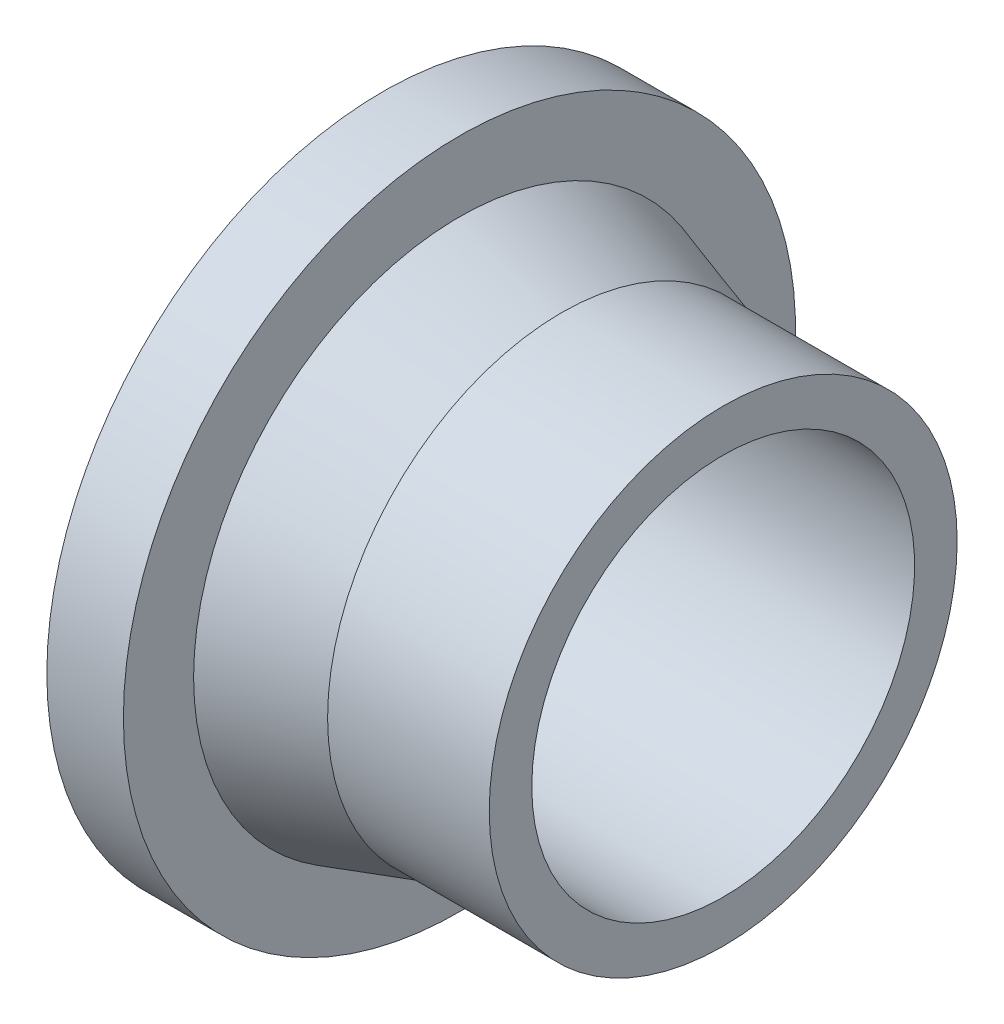
ISO-10303-21;
HEADER;
FILE_DESCRIPTION(('STEP AP214'),'2;1');
FILE_NAME('part.step','',(''),(''),'','','');
FILE_SCHEMA(('AUTOMOTIVE_DESIGN { 1 0 10303 214 1 1 1 1 }'));
ENDSEC;
DATA;
#1=APPLICATION_CONTEXT('core data for automotive mechanical design processes');
#2=APPLICATION_PROTOCOL_DEFINITION('international standard','automotive_design',2000,#1);
#3=PRODUCT_CONTEXT('',#1,'mechanical');
#4=PRODUCT('Part','Part','',(#3));
#5=PRODUCT_RELATED_PRODUCT_CATEGORY('part','',(#4));
#6=PRODUCT_DEFINITION_FORMATION('','',#4);
#7=PRODUCT_DEFINITION_CONTEXT('part definition',#1,'design');
#8=PRODUCT_DEFINITION('design','',#6,#7);
#9=PRODUCT_DEFINITION_SHAPE('','',#8);
#10=(LENGTH_UNIT() NAMED_UNIT(*) SI_UNIT(.MILLI.,.METRE.));
#11=(NAMED_UNIT(*) PLANE_ANGLE_UNIT() SI_UNIT($,.RADIAN.));
#12=(NAMED_UNIT(*) SI_UNIT($,.STERADIAN.) SOLID_ANGLE_UNIT());
#13=UNCERTAINTY_MEASURE_WITH_UNIT(LENGTH_MEASURE(1.E-05),#10,'distance_accuracy_value','');
#14=(GEOMETRIC_REPRESENTATION_CONTEXT(3) GLOBAL_UNCERTAINTY_ASSIGNED_CONTEXT((#13)) GLOBAL_UNIT_ASSIGNED_CONTEXT((#10,
#11,#12)) REPRESENTATION_CONTEXT('',''));
#15=CARTESIAN_POINT('',(0.,0.,0.));
#16=DIRECTION('',(0.,0.,1.));
#17=DIRECTION('',(1.,0.,0.));
#18=AXIS2_PLACEMENT_3D('',#15,#16,#17);
#19=CARTESIAN_POINT('',(-38.,0.,0.));
#20=DIRECTION('',(-1.,0.,0.));
#21=DIRECTION('',(0.,0.,1.));
#22=AXIS2_PLACEMENT_3D('',#19,#20,#21);
#23=CONICAL_SURFACE('',#22,55.,0.302884868374971);
#24=CARTESIAN_POINT('',(-62.,0.,0.));
#25=DIRECTION('',(-1.,0.,0.));
#26=DIRECTION('',(0.,0.,1.));
#27=AXIS2_PLACEMENT_3D('',#24,#25,#26);
#28=CIRCLE('',#27,62.5);
#29=CARTESIAN_POINT('',(-62.,0.,62.5));
#30=VERTEX_POINT('',#29);
#31=EDGE_CURVE('E16',#30,#30,#28,.T.);
#32=ORIENTED_EDGE('',*,*,#31,.F.);
#33=EDGE_LOOP('',(#32));
#34=FACE_BOUND('',#33,.T.);
#35=CARTESIAN_POINT('',(-38.,0.,0.));
#36=DIRECTION('',(-1.,0.,0.));
#37=DIRECTION('',(0.,1.,0.));
#38=AXIS2_PLACEMENT_3D('',#35,#36,#37);
#39=CIRCLE('',#38,55.);
#40=CARTESIAN_POINT('',(-38.,55.,0.));
#41=VERTEX_POINT('',#40);
#42=EDGE_CURVE('E28',#41,#41,#39,.F.);
#43=ORIENTED_EDGE('',*,*,#42,.F.);
#44=EDGE_LOOP('',(#43));
#45=FACE_BOUND('',#44,.T.);
#46=ADVANCED_FACE('F13',(#34,#45),#23,.T.);
#47=CARTESIAN_POINT('',(-62.,79.,79.9480031625341));
#48=DIRECTION('',(1.,0.,0.));
#49=DIRECTION('',(0.,-1.,0.));
#50=AXIS2_PLACEMENT_3D('',#47,#48,#49);
#51=PLANE('',#50);
#52=ORIENTED_EDGE('',*,*,#31,.T.);
#53=EDGE_LOOP('',(#52));
#54=FACE_BOUND('',#53,.T.);
#55=CARTESIAN_POINT('',(-62.,0.,0.));
#56=DIRECTION('',(-1.,0.,0.));
#57=DIRECTION('',(0.,0.,1.));
#58=AXIS2_PLACEMENT_3D('',#55,#56,#57);
#59=CIRCLE('',#58,79.);
#60=CARTESIAN_POINT('',(-62.,0.,79.));
#61=VERTEX_POINT('',#60);
#62=EDGE_CURVE('E34',#61,#61,#59,.T.);
#63=ORIENTED_EDGE('',*,*,#62,.F.);
#64=EDGE_LOOP('',(#63));
#65=FACE_BOUND('',#64,.T.);
#66=ADVANCED_FACE('F44',(#54,#65),#51,.T.);
#67=CARTESIAN_POINT('',(-38.,0.,0.));
#68=DIRECTION('',(-1.,0.,0.));
#69=DIRECTION('',(0.,0.,1.));
#70=AXIS2_PLACEMENT_3D('',#67,#68,#69);
#71=CYLINDRICAL_SURFACE('',#70,55.);
#72=ORIENTED_EDGE('',*,*,#42,.T.);
#73=EDGE_LOOP('',(#72));
#74=FACE_BOUND('',#73,.T.);
#75=CARTESIAN_POINT('',(0.,0.,0.));
#76=DIRECTION('',(-1.,0.,0.));
#77=DIRECTION('',(0.,0.,1.));
#78=AXIS2_PLACEMENT_3D('',#75,#76,#77);
#79=CIRCLE('',#78,55.);
#80=CARTESIAN_POINT('',(0.,0.,55.));
#81=VERTEX_POINT('',#80);
#82=EDGE_CURVE('E32',#81,#81,#79,.F.);
#83=ORIENTED_EDGE('',*,*,#82,.F.);
#84=EDGE_LOOP('',(#83));
#85=FACE_BOUND('',#84,.T.);
#86=ADVANCED_FACE('F53',(#74,#85),#71,.T.);
#87=CARTESIAN_POINT('',(-80.,0.,0.));
#88=DIRECTION('',(-1.,0.,0.));
#89=DIRECTION('',(0.,0.,1.));
#90=AXIS2_PLACEMENT_3D('',#87,#88,#89);
#91=CYLINDRICAL_SURFACE('',#90,79.);
#92=CARTESIAN_POINT('',(-80.,0.,0.));
#93=DIRECTION('',(-1.,0.,0.));
#94=DIRECTION('',(0.,0.,1.));
#95=AXIS2_PLACEMENT_3D('',#92,#93,#94);
#96=CIRCLE('',#95,79.);
#97=CARTESIAN_POINT('',(-80.,0.,79.));
#98=VERTEX_POINT('',#97);
#99=EDGE_CURVE('E25',#98,#98,#96,.T.);
#100=ORIENTED_EDGE('',*,*,#99,.F.);
#101=EDGE_LOOP('',(#100));
#102=FACE_BOUND('',#101,.T.);
#103=ORIENTED_EDGE('',*,*,#62,.T.);
#104=EDGE_LOOP('',(#103));
#105=FACE_BOUND('',#104,.T.);
#106=ADVANCED_FACE('F68',(#102,#105),#91,.T.);
#107=CARTESIAN_POINT('',(0.,55.,55.6600021081709));
#108=DIRECTION('',(1.,0.,0.));
#109=DIRECTION('',(0.,-1.,0.));
#110=AXIS2_PLACEMENT_3D('',#107,#108,#109);
#111=PLANE('',#110);
#112=CARTESIAN_POINT('',(0.,0.,0.));
#113=DIRECTION('',(-1.,0.,0.));
#114=DIRECTION('',(0.,0.,1.));
#115=AXIS2_PLACEMENT_3D('',#112,#113,#114);
#116=CIRCLE('',#115,45.);
#117=CARTESIAN_POINT('',(0.,0.,45.));
#118=VERTEX_POINT('',#117);
#119=EDGE_CURVE('E20',#118,#118,#116,.F.);
#120=ORIENTED_EDGE('',*,*,#119,.F.);
#121=EDGE_LOOP('',(#120));
#122=FACE_BOUND('',#121,.T.);
#123=ORIENTED_EDGE('',*,*,#82,.T.);
#124=EDGE_LOOP('',(#123));
#125=FACE_BOUND('',#124,.T.);
#126=ADVANCED_FACE('F62',(#122,#125),#111,.T.);
#127=CARTESIAN_POINT('',(-80.,-79.,79.9480031625361));
#128=DIRECTION('',(-1.,0.,0.));
#129=DIRECTION('',(0.,1.,0.));
#130=AXIS2_PLACEMENT_3D('',#127,#128,#129);
#131=PLANE('',#130);
#132=CARTESIAN_POINT('',(-80.,0.,0.));
#133=DIRECTION('',(-1.,0.,0.));
#134=DIRECTION('',(0.,0.,1.));
#135=AXIS2_PLACEMENT_3D('',#132,#133,#134);
#136=CIRCLE('',#135,45.);
#137=CARTESIAN_POINT('',(-80.,0.,45.));
#138=VERTEX_POINT('',#137);
#139=EDGE_CURVE('E8',#138,#138,#136,.T.);
#140=ORIENTED_EDGE('',*,*,#139,.F.);
#141=EDGE_LOOP('',(#140));
#142=FACE_BOUND('',#141,.T.);
#143=ORIENTED_EDGE('',*,*,#99,.T.);
#144=EDGE_LOOP('',(#143));
#145=FACE_BOUND('',#144,.T.);
#146=ADVANCED_FACE('F56',(#142,#145),#131,.T.);
#147=CARTESIAN_POINT('',(0.,0.,0.));
#148=DIRECTION('',(-1.,0.,0.));
#149=DIRECTION('',(0.,0.,1.));
#150=AXIS2_PLACEMENT_3D('',#147,#148,#149);
#151=CYLINDRICAL_SURFACE('',#150,45.);
#152=ORIENTED_EDGE('',*,*,#119,.T.);
#153=EDGE_LOOP('',(#152));
#154=FACE_BOUND('',#153,.T.);
#155=ORIENTED_EDGE('',*,*,#139,.T.);
#156=EDGE_LOOP('',(#155));
#157=FACE_BOUND('',#156,.T.);
#158=ADVANCED_FACE('F54',(#154,#157),#151,.F.);
#159=CLOSED_SHELL('',(#46,#66,#86,#106,#126,#146,#158));
#160=MANIFOLD_SOLID_BREP('B1',#159);
#161=ADVANCED_BREP_SHAPE_REPRESENTATION('',(#18,#160),#14);
#162=SHAPE_DEFINITION_REPRESENTATION(#9,#161);
ENDSEC;
END-ISO-10303-21;
